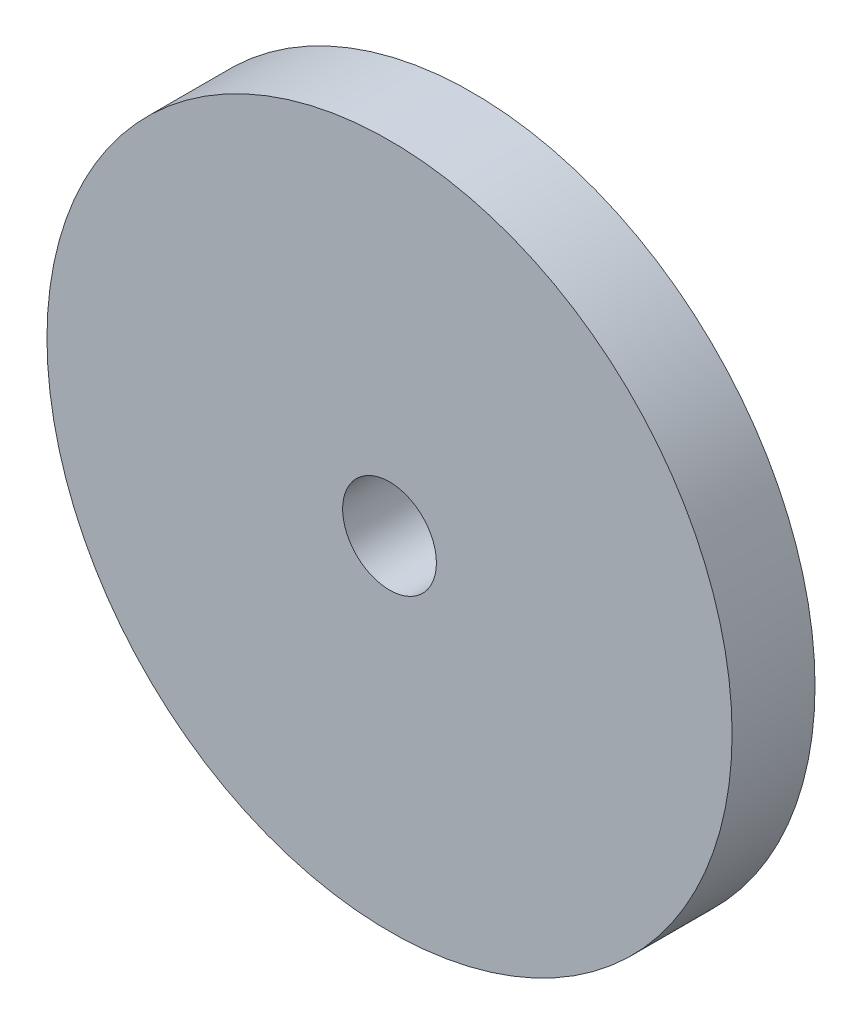
ISO-10303-21;
HEADER;
FILE_DESCRIPTION(('STEP AP214'),'2;1');
FILE_NAME('part.step','',(''),(''),'','','');
FILE_SCHEMA(('AUTOMOTIVE_DESIGN { 1 0 10303 214 1 1 1 1 }'));
ENDSEC;
DATA;
#1=APPLICATION_CONTEXT('core data for automotive mechanical design processes');
#2=APPLICATION_PROTOCOL_DEFINITION('international standard','automotive_design',2000,#1);
#3=PRODUCT_CONTEXT('',#1,'mechanical');
#4=PRODUCT('Part','Part','',(#3));
#5=PRODUCT_RELATED_PRODUCT_CATEGORY('part','',(#4));
#6=PRODUCT_DEFINITION_FORMATION('','',#4);
#7=PRODUCT_DEFINITION_CONTEXT('part definition',#1,'design');
#8=PRODUCT_DEFINITION('design','',#6,#7);
#9=PRODUCT_DEFINITION_SHAPE('','',#8);
#10=(LENGTH_UNIT() NAMED_UNIT(*) SI_UNIT(.MILLI.,.METRE.));
#11=(NAMED_UNIT(*) PLANE_ANGLE_UNIT() SI_UNIT($,.RADIAN.));
#12=(NAMED_UNIT(*) SI_UNIT($,.STERADIAN.) SOLID_ANGLE_UNIT());
#13=UNCERTAINTY_MEASURE_WITH_UNIT(LENGTH_MEASURE(1.E-05),#10,'distance_accuracy_value','');
#14=(GEOMETRIC_REPRESENTATION_CONTEXT(3) GLOBAL_UNCERTAINTY_ASSIGNED_CONTEXT((#13)) GLOBAL_UNIT_ASSIGNED_CONTEXT((#10,
#11,#12)) REPRESENTATION_CONTEXT('',''));
#15=CARTESIAN_POINT('',(0.,0.,0.));
#16=DIRECTION('',(0.,0.,1.));
#17=DIRECTION('',(1.,0.,0.));
#18=AXIS2_PLACEMENT_3D('',#15,#16,#17);
#19=CARTESIAN_POINT('',(0.,0.,2.3));
#20=DIRECTION('',(0.,0.,1.));
#21=DIRECTION('',(1.,0.,0.));
#22=AXIS2_PLACEMENT_3D('',#19,#20,#21);
#23=PLANE('',#22);
#24=CARTESIAN_POINT('',(0.,0.,2.3));
#25=DIRECTION('',(0.,0.,1.));
#26=DIRECTION('',(1.,0.,0.));
#27=AXIS2_PLACEMENT_3D('',#24,#25,#26);
#28=CIRCLE('',#27,9.5);
#29=CARTESIAN_POINT('',(9.5,0.,2.3));
#30=VERTEX_POINT('',#29);
#31=EDGE_CURVE('E10',#30,#30,#28,.T.);
#32=ORIENTED_EDGE('',*,*,#31,.T.);
#33=EDGE_LOOP('',(#32));
#34=FACE_BOUND('',#33,.T.);
#35=CARTESIAN_POINT('',(0.,0.,2.3));
#36=DIRECTION('',(0.,0.,1.));
#37=DIRECTION('',(1.,0.,0.));
#38=AXIS2_PLACEMENT_3D('',#35,#36,#37);
#39=CIRCLE('',#38,1.3);
#40=CARTESIAN_POINT('',(1.3,0.,2.3));
#41=VERTEX_POINT('',#40);
#42=EDGE_CURVE('E43',#41,#41,#39,.T.);
#43=ORIENTED_EDGE('',*,*,#42,.F.);
#44=EDGE_LOOP('',(#43));
#45=FACE_BOUND('',#44,.T.);
#46=ADVANCED_FACE('F32',(#34,#45),#23,.T.);
#47=CARTESIAN_POINT('',(0.,0.,0.));
#48=DIRECTION('',(0.,0.,1.));
#49=DIRECTION('',(1.,0.,0.));
#50=AXIS2_PLACEMENT_3D('',#47,#48,#49);
#51=PLANE('',#50);
#52=CARTESIAN_POINT('',(0.,0.,0.));
#53=DIRECTION('',(0.,0.,1.));
#54=DIRECTION('',(1.,0.,0.));
#55=AXIS2_PLACEMENT_3D('',#52,#53,#54);
#56=CIRCLE('',#55,9.5);
#57=CARTESIAN_POINT('',(9.5,0.,0.));
#58=VERTEX_POINT('',#57);
#59=EDGE_CURVE('E36',#58,#58,#56,.T.);
#60=ORIENTED_EDGE('',*,*,#59,.F.);
#61=EDGE_LOOP('',(#60));
#62=FACE_BOUND('',#61,.T.);
#63=CARTESIAN_POINT('',(0.,0.,0.));
#64=DIRECTION('',(0.,0.,1.));
#65=DIRECTION('',(1.,0.,0.));
#66=AXIS2_PLACEMENT_3D('',#63,#64,#65);
#67=CIRCLE('',#66,1.3);
#68=CARTESIAN_POINT('',(1.3,0.,0.));
#69=VERTEX_POINT('',#68);
#70=EDGE_CURVE('E45',#69,#69,#67,.T.);
#71=ORIENTED_EDGE('',*,*,#70,.T.);
#72=EDGE_LOOP('',(#71));
#73=FACE_BOUND('',#72,.T.);
#74=ADVANCED_FACE('F55',(#62,#73),#51,.F.);
#75=CARTESIAN_POINT('',(0.,0.,2.3));
#76=DIRECTION('',(0.,0.,-1.));
#77=DIRECTION('',(-1.,0.,0.));
#78=AXIS2_PLACEMENT_3D('',#75,#76,#77);
#79=CYLINDRICAL_SURFACE('',#78,9.5);
#80=ORIENTED_EDGE('',*,*,#31,.F.);
#81=EDGE_LOOP('',(#80));
#82=FACE_BOUND('',#81,.T.);
#83=ORIENTED_EDGE('',*,*,#59,.T.);
#84=EDGE_LOOP('',(#83));
#85=FACE_BOUND('',#84,.T.);
#86=ADVANCED_FACE('F34',(#82,#85),#79,.T.);
#87=CARTESIAN_POINT('',(0.,0.,2.3));
#88=DIRECTION('',(0.,0.,-1.));
#89=DIRECTION('',(-1.,0.,0.));
#90=AXIS2_PLACEMENT_3D('',#87,#88,#89);
#91=CYLINDRICAL_SURFACE('',#90,1.3);
#92=ORIENTED_EDGE('',*,*,#42,.T.);
#93=EDGE_LOOP('',(#92));
#94=FACE_BOUND('',#93,.T.);
#95=ORIENTED_EDGE('',*,*,#70,.F.);
#96=EDGE_LOOP('',(#95));
#97=FACE_BOUND('',#96,.T.);
#98=ADVANCED_FACE('F51',(#94,#97),#91,.F.);
#99=CLOSED_SHELL('',(#46,#74,#86,#98));
#100=MANIFOLD_SOLID_BREP('B2',#99);
#101=ADVANCED_BREP_SHAPE_REPRESENTATION('',(#18,#100),#14);
#102=SHAPE_DEFINITION_REPRESENTATION(#9,#101);
ENDSEC;
END-ISO-10303-21;
